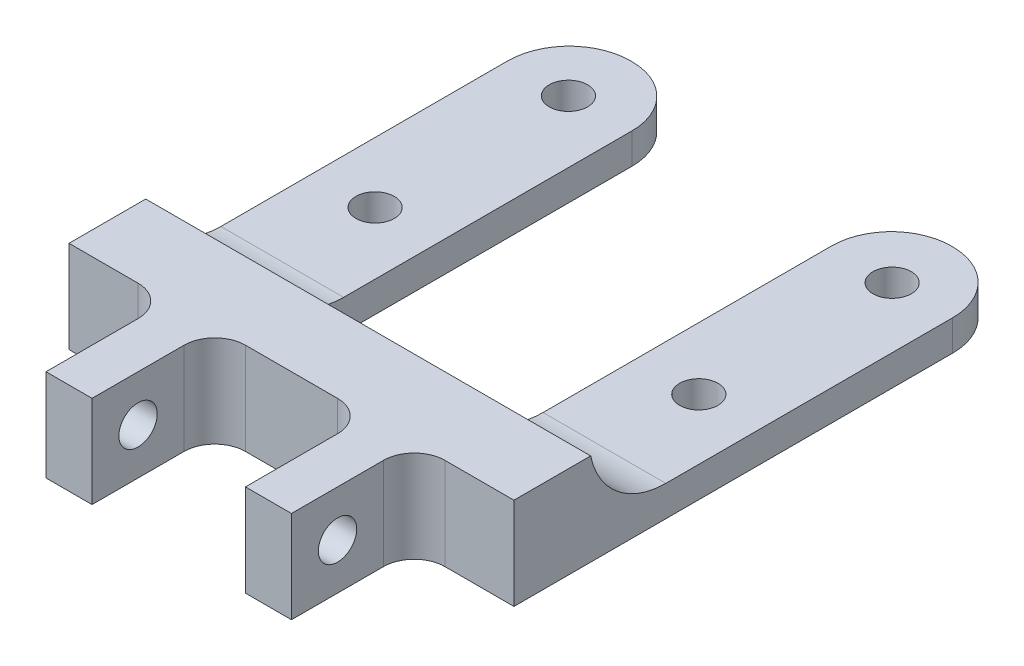
ISO-10303-21;
HEADER;
FILE_DESCRIPTION(('STEP AP214'),'2;1');
FILE_NAME('part.step','',(''),(''),'','','');
FILE_SCHEMA(('AUTOMOTIVE_DESIGN { 1 0 10303 214 1 1 1 1 }'));
ENDSEC;
DATA;
#1=APPLICATION_CONTEXT('core data for automotive mechanical design processes');
#2=APPLICATION_PROTOCOL_DEFINITION('international standard','automotive_design',2000,#1);
#3=PRODUCT_CONTEXT('',#1,'mechanical');
#4=PRODUCT('Part','Part','',(#3));
#5=PRODUCT_RELATED_PRODUCT_CATEGORY('part','',(#4));
#6=PRODUCT_DEFINITION_FORMATION('','',#4);
#7=PRODUCT_DEFINITION_CONTEXT('part definition',#1,'design');
#8=PRODUCT_DEFINITION('design','',#6,#7);
#9=PRODUCT_DEFINITION_SHAPE('','',#8);
#10=(LENGTH_UNIT() NAMED_UNIT(*) SI_UNIT(.MILLI.,.METRE.));
#11=(NAMED_UNIT(*) PLANE_ANGLE_UNIT() SI_UNIT($,.RADIAN.));
#12=(NAMED_UNIT(*) SI_UNIT($,.STERADIAN.) SOLID_ANGLE_UNIT());
#13=UNCERTAINTY_MEASURE_WITH_UNIT(LENGTH_MEASURE(1.E-05),#10,'distance_accuracy_value','');
#14=(GEOMETRIC_REPRESENTATION_CONTEXT(3) GLOBAL_UNCERTAINTY_ASSIGNED_CONTEXT((#13)) GLOBAL_UNIT_ASSIGNED_CONTEXT((#10,
#11,#12)) REPRESENTATION_CONTEXT('',''));
#15=CARTESIAN_POINT('',(0.,0.,0.));
#16=DIRECTION('',(0.,0.,1.));
#17=DIRECTION('',(1.,0.,0.));
#18=AXIS2_PLACEMENT_3D('',#15,#16,#17);
#19=CARTESIAN_POINT('',(0.,0.,5.));
#20=DIRECTION('',(0.,0.,1.));
#21=DIRECTION('',(1.,0.,0.));
#22=AXIS2_PLACEMENT_3D('',#19,#20,#21);
#23=PLANE('',#22);
#24=DIRECTION('',(1.,0.,0.));
#25=VECTOR('',#24,1.);
#26=CARTESIAN_POINT('',(0.,0.,5.));
#27=LINE('',#26,#25);
#28=CARTESIAN_POINT('',(11.5,0.,5.));
#29=VERTEX_POINT('',#28);
#30=CARTESIAN_POINT('',(17.5,0.,5.));
#31=VERTEX_POINT('',#30);
#32=EDGE_CURVE('E286',#29,#31,#27,.T.);
#33=ORIENTED_EDGE('',*,*,#32,.T.);
#34=DIRECTION('',(0.,-1.,0.));
#35=VECTOR('',#34,1.);
#36=CARTESIAN_POINT('',(17.5,0.,5.));
#37=LINE('',#36,#35);
#38=CARTESIAN_POINT('',(17.5,6.,5.));
#39=VERTEX_POINT('',#38);
#40=EDGE_CURVE('E414',#31,#39,#37,.F.);
#41=ORIENTED_EDGE('',*,*,#40,.T.);
#42=DIRECTION('',(1.,0.,0.));
#43=VECTOR('',#42,1.);
#44=CARTESIAN_POINT('',(0.,6.,5.));
#45=LINE('',#44,#43);
#46=CARTESIAN_POINT('',(11.5,6.,5.));
#47=VERTEX_POINT('',#46);
#48=EDGE_CURVE('E277',#47,#39,#45,.T.);
#49=ORIENTED_EDGE('',*,*,#48,.F.);
#50=DIRECTION('',(0.,1.,0.));
#51=VECTOR('',#50,1.);
#52=CARTESIAN_POINT('',(11.5,0.,5.));
#53=LINE('',#52,#51);
#54=EDGE_CURVE('E412',#47,#29,#53,.F.);
#55=ORIENTED_EDGE('',*,*,#54,.T.);
#56=EDGE_LOOP('',(#33,#41,#49,#55));
#57=FACE_BOUND('',#56,.T.);
#58=ADVANCED_FACE('F39',(#57),#23,.T.);
#59=CARTESIAN_POINT('',(24.5,6.,5.));
#60=VERTEX_POINT('',#59);
#61=CARTESIAN_POINT('',(29.,6.,5.));
#62=VERTEX_POINT('',#61);
#63=EDGE_CURVE('E273',#60,#62,#45,.T.);
#64=ORIENTED_EDGE('',*,*,#63,.F.);
#65=DIRECTION('',(0.,1.,0.));
#66=VECTOR('',#65,1.);
#67=CARTESIAN_POINT('',(24.5,0.,5.));
#68=LINE('',#67,#66);
#69=CARTESIAN_POINT('',(24.5,0.,5.));
#70=VERTEX_POINT('',#69);
#71=EDGE_CURVE('E419',#60,#70,#68,.F.);
#72=ORIENTED_EDGE('',*,*,#71,.T.);
#73=CARTESIAN_POINT('',(29.,0.,5.));
#74=VERTEX_POINT('',#73);
#75=EDGE_CURVE('E282',#70,#74,#27,.T.);
#76=ORIENTED_EDGE('',*,*,#75,.T.);
#77=DIRECTION('',(0.,1.,0.));
#78=VECTOR('',#77,1.);
#79=CARTESIAN_POINT('',(29.,0.,5.));
#80=LINE('',#79,#78);
#81=EDGE_CURVE('E287',#74,#62,#80,.T.);
#82=ORIENTED_EDGE('',*,*,#81,.T.);
#83=EDGE_LOOP('',(#64,#72,#76,#82));
#84=FACE_BOUND('',#83,.T.);
#85=ADVANCED_FACE('F467',(#84),#23,.T.);
#86=CARTESIAN_POINT('',(0.,2.,0.));
#87=DIRECTION('',(0.,1.,0.));
#88=DIRECTION('',(0.,0.,1.));
#89=AXIS2_PLACEMENT_3D('',#86,#87,#88);
#90=PLANE('',#89);
#91=CARTESIAN_POINT('',(3.95,2.,-23.6));
#92=DIRECTION('',(0.,1.,0.));
#93=DIRECTION('',(0.,0.,1.));
#94=AXIS2_PLACEMENT_3D('',#91,#92,#93);
#95=CIRCLE('',#94,1.25);
#96=CARTESIAN_POINT('',(3.95,2.,-22.35));
#97=VERTEX_POINT('',#96);
#98=EDGE_CURVE('E329',#97,#97,#95,.T.);
#99=ORIENTED_EDGE('',*,*,#98,.F.);
#100=EDGE_LOOP('',(#99));
#101=FACE_BOUND('',#100,.T.);
#102=CARTESIAN_POINT('',(3.95,2.,-11.));
#103=DIRECTION('',(0.,1.,0.));
#104=DIRECTION('',(0.,0.,1.));
#105=AXIS2_PLACEMENT_3D('',#102,#103,#104);
#106=CIRCLE('',#105,1.25);
#107=CARTESIAN_POINT('',(3.95,2.,-9.75));
#108=VERTEX_POINT('',#107);
#109=EDGE_CURVE('E320',#108,#108,#106,.T.);
#110=ORIENTED_EDGE('',*,*,#109,.F.);
#111=EDGE_LOOP('',(#110));
#112=FACE_BOUND('',#111,.T.);
#113=DIRECTION('',(0.,0.,-1.));
#114=VECTOR('',#113,1.);
#115=CARTESIAN_POINT('',(0.,2.,0.));
#116=LINE('',#115,#114);
#117=CARTESIAN_POINT('',(0.,2.,-4.89897948556636));
#118=VERTEX_POINT('',#117);
#119=CARTESIAN_POINT('',(0.,2.,-23.6));
#120=VERTEX_POINT('',#119);
#121=EDGE_CURVE('E302',#118,#120,#116,.T.);
#122=ORIENTED_EDGE('',*,*,#121,.F.);
#123=DIRECTION('',(-1.,0.,0.));
#124=VECTOR('',#123,1.);
#125=CARTESIAN_POINT('',(29.,2.,-4.89897948556636));
#126=LINE('',#125,#124);
#127=CARTESIAN_POINT('',(8.,2.,-4.89897948556636));
#128=VERTEX_POINT('',#127);
#129=EDGE_CURVE('E396',#118,#128,#126,.F.);
#130=ORIENTED_EDGE('',*,*,#129,.T.);
#131=DIRECTION('',(0.,0.,1.));
#132=VECTOR('',#131,1.);
#133=CARTESIAN_POINT('',(8.,2.,0.));
#134=LINE('',#133,#132);
#135=CARTESIAN_POINT('',(8.,2.,-23.7));
#136=VERTEX_POINT('',#135);
#137=EDGE_CURVE('E317',#136,#128,#134,.T.);
#138=ORIENTED_EDGE('',*,*,#137,.F.);
#139=CARTESIAN_POINT('',(4.1,2.,-23.7));
#140=DIRECTION('',(0.,1.,0.));
#141=DIRECTION('',(0.,0.,1.));
#142=AXIS2_PLACEMENT_3D('',#139,#140,#141);
#143=CIRCLE('',#142,3.9);
#144=CARTESIAN_POINT('',(4.1,2.,-27.6));
#145=VERTEX_POINT('',#144);
#146=EDGE_CURVE('E292',#145,#136,#143,.F.);
#147=ORIENTED_EDGE('',*,*,#146,.F.);
#148=DIRECTION('',(1.,0.,0.));
#149=VECTOR('',#148,1.);
#150=CARTESIAN_POINT('',(0.,2.,-27.6));
#151=LINE('',#150,#149);
#152=CARTESIAN_POINT('',(4.,2.,-27.6));
#153=VERTEX_POINT('',#152);
#154=EDGE_CURVE('E295',#153,#145,#151,.T.);
#155=ORIENTED_EDGE('',*,*,#154,.F.);
#156=CARTESIAN_POINT('',(4.,2.,-23.6));
#157=DIRECTION('',(0.,1.,0.));
#158=DIRECTION('',(0.,0.,1.));
#159=AXIS2_PLACEMENT_3D('',#156,#157,#158);
#160=CIRCLE('',#159,4.);
#161=EDGE_CURVE('E299',#120,#153,#160,.F.);
#162=ORIENTED_EDGE('',*,*,#161,.F.);
#163=EDGE_LOOP('',(#122,#130,#138,#147,#155,#162));
#164=FACE_BOUND('',#163,.T.);
#165=ADVANCED_FACE('F513',(#101,#112,#164),#90,.T.);
#166=CARTESIAN_POINT('',(4.1,2.,-23.7));
#167=DIRECTION('',(0.,-1.,0.));
#168=DIRECTION('',(0.,0.,-1.));
#169=AXIS2_PLACEMENT_3D('',#166,#167,#168);
#170=CYLINDRICAL_SURFACE('',#169,3.9);
#171=CARTESIAN_POINT('',(4.1,0.,-23.7));
#172=DIRECTION('',(0.,1.,0.));
#173=DIRECTION('',(0.,0.,1.));
#174=AXIS2_PLACEMENT_3D('',#171,#172,#173);
#175=CIRCLE('',#174,3.9);
#176=CARTESIAN_POINT('',(4.1,0.,-27.6));
#177=VERTEX_POINT('',#176);
#178=CARTESIAN_POINT('',(8.,0.,-23.7));
#179=VERTEX_POINT('',#178);
#180=EDGE_CURVE('E290',#177,#179,#175,.F.);
#181=ORIENTED_EDGE('',*,*,#180,.F.);
#182=DIRECTION('',(0.,-1.,0.));
#183=VECTOR('',#182,1.);
#184=CARTESIAN_POINT('',(4.1,2.,-27.6));
#185=LINE('',#184,#183);
#186=EDGE_CURVE('E392',#145,#177,#185,.T.);
#187=ORIENTED_EDGE('',*,*,#186,.F.);
#188=ORIENTED_EDGE('',*,*,#146,.T.);
#189=DIRECTION('',(0.,-1.,0.));
#190=VECTOR('',#189,1.);
#191=CARTESIAN_POINT('',(8.,2.,-23.7));
#192=LINE('',#191,#190);
#193=EDGE_CURVE('E332',#136,#179,#192,.T.);
#194=ORIENTED_EDGE('',*,*,#193,.T.);
#195=EDGE_LOOP('',(#181,#187,#188,#194));
#196=FACE_BOUND('',#195,.T.);
#197=ADVANCED_FACE('F579',(#196),#170,.T.);
#198=CARTESIAN_POINT('',(0.,2.,-27.6));
#199=DIRECTION('',(0.,0.,-1.));
#200=DIRECTION('',(-1.,0.,0.));
#201=AXIS2_PLACEMENT_3D('',#198,#199,#200);
#202=PLANE('',#201);
#203=DIRECTION('',(1.,0.,0.));
#204=VECTOR('',#203,1.);
#205=CARTESIAN_POINT('',(0.,0.,-27.6));
#206=LINE('',#205,#204);
#207=CARTESIAN_POINT('',(4.,0.,-27.6));
#208=VERTEX_POINT('',#207);
#209=EDGE_CURVE('E334',#208,#177,#206,.T.);
#210=ORIENTED_EDGE('',*,*,#209,.F.);
#211=DIRECTION('',(0.,-1.,0.));
#212=VECTOR('',#211,1.);
#213=CARTESIAN_POINT('',(4.,2.,-27.6));
#214=LINE('',#213,#212);
#215=EDGE_CURVE('E390',#153,#208,#214,.T.);
#216=ORIENTED_EDGE('',*,*,#215,.F.);
#217=ORIENTED_EDGE('',*,*,#154,.T.);
#218=ORIENTED_EDGE('',*,*,#186,.T.);
#219=EDGE_LOOP('',(#210,#216,#217,#218));
#220=FACE_BOUND('',#219,.T.);
#221=ADVANCED_FACE('F575',(#220),#202,.T.);
#222=CARTESIAN_POINT('',(4.,2.,-23.6));
#223=DIRECTION('',(0.,-1.,0.));
#224=DIRECTION('',(0.,0.,-1.));
#225=AXIS2_PLACEMENT_3D('',#222,#223,#224);
#226=CYLINDRICAL_SURFACE('',#225,4.);
#227=CARTESIAN_POINT('',(4.,0.,-23.6));
#228=DIRECTION('',(0.,1.,0.));
#229=DIRECTION('',(0.,0.,1.));
#230=AXIS2_PLACEMENT_3D('',#227,#228,#229);
#231=CIRCLE('',#230,4.);
#232=CARTESIAN_POINT('',(0.,0.,-23.6));
#233=VERTEX_POINT('',#232);
#234=EDGE_CURVE('E337',#233,#208,#231,.F.);
#235=ORIENTED_EDGE('',*,*,#234,.F.);
#236=DIRECTION('',(0.,-1.,0.));
#237=VECTOR('',#236,1.);
#238=CARTESIAN_POINT('',(0.,2.,-23.6));
#239=LINE('',#238,#237);
#240=EDGE_CURVE('E388',#120,#233,#239,.T.);
#241=ORIENTED_EDGE('',*,*,#240,.F.);
#242=ORIENTED_EDGE('',*,*,#161,.T.);
#243=ORIENTED_EDGE('',*,*,#215,.T.);
#244=EDGE_LOOP('',(#235,#241,#242,#243));
#245=FACE_BOUND('',#244,.T.);
#246=ADVANCED_FACE('F572',(#245),#226,.T.);
#247=CARTESIAN_POINT('',(0.,2.,0.));
#248=DIRECTION('',(-1.,0.,0.));
#249=DIRECTION('',(0.,0.,1.));
#250=AXIS2_PLACEMENT_3D('',#247,#248,#249);
#251=PLANE('',#250);
#252=DIRECTION('',(0.,0.,-1.));
#253=VECTOR('',#252,1.);
#254=CARTESIAN_POINT('',(0.,0.,0.));
#255=LINE('',#254,#253);
#256=CARTESIAN_POINT('',(0.,0.,5.));
#257=VERTEX_POINT('',#256);
#258=EDGE_CURVE('E340',#257,#233,#255,.T.);
#259=ORIENTED_EDGE('',*,*,#258,.F.);
#260=DIRECTION('',(0.,1.,0.));
#261=VECTOR('',#260,1.);
#262=CARTESIAN_POINT('',(0.,0.,5.));
#263=LINE('',#262,#261);
#264=CARTESIAN_POINT('',(0.,6.,5.));
#265=VERTEX_POINT('',#264);
#266=EDGE_CURVE('E285',#257,#265,#263,.T.);
#267=ORIENTED_EDGE('',*,*,#266,.T.);
#268=DIRECTION('',(0.,0.,1.));
#269=VECTOR('',#268,1.);
#270=CARTESIAN_POINT('',(0.,6.,0.));
#271=LINE('',#270,#269);
#272=CARTESIAN_POINT('',(0.,6.,0.));
#273=VERTEX_POINT('',#272);
#274=EDGE_CURVE('E270',#273,#265,#271,.T.);
#275=ORIENTED_EDGE('',*,*,#274,.F.);
#276=CARTESIAN_POINT('',(0.,7.,-4.89897948556636));
#277=DIRECTION('',(-1.,0.,0.));
#278=DIRECTION('',(0.,0.,1.));
#279=AXIS2_PLACEMENT_3D('',#276,#277,#278);
#280=CIRCLE('',#279,5.);
#281=EDGE_CURVE('E409',#273,#118,#280,.F.);
#282=ORIENTED_EDGE('',*,*,#281,.T.);
#283=ORIENTED_EDGE('',*,*,#121,.T.);
#284=ORIENTED_EDGE('',*,*,#240,.T.);
#285=EDGE_LOOP('',(#259,#267,#275,#282,#283,#284));
#286=FACE_BOUND('',#285,.T.);
#287=ADVANCED_FACE('F483',(#286),#251,.T.);
#288=CARTESIAN_POINT('',(29.,2.,0.));
#289=DIRECTION('',(-1.,0.,0.));
#290=DIRECTION('',(0.,0.,1.));
#291=AXIS2_PLACEMENT_3D('',#288,#289,#290);
#292=PLANE('',#291);
#293=DIRECTION('',(0.,0.,-1.));
#294=VECTOR('',#293,1.);
#295=CARTESIAN_POINT('',(29.,0.,0.));
#296=LINE('',#295,#294);
#297=CARTESIAN_POINT('',(29.,0.,-23.6));
#298=VERTEX_POINT('',#297);
#299=EDGE_CURVE('E343',#74,#298,#296,.T.);
#300=ORIENTED_EDGE('',*,*,#299,.T.);
#301=DIRECTION('',(0.,-1.,0.));
#302=VECTOR('',#301,1.);
#303=CARTESIAN_POINT('',(29.,2.,-23.6));
#304=LINE('',#303,#302);
#305=CARTESIAN_POINT('',(29.,2.,-23.6));
#306=VERTEX_POINT('',#305);
#307=EDGE_CURVE('E386',#306,#298,#304,.T.);
#308=ORIENTED_EDGE('',*,*,#307,.F.);
#309=DIRECTION('',(0.,0.,-1.));
#310=VECTOR('',#309,1.);
#311=CARTESIAN_POINT('',(29.,2.,0.));
#312=LINE('',#311,#310);
#313=CARTESIAN_POINT('',(29.,2.,-4.89897948556636));
#314=VERTEX_POINT('',#313);
#315=EDGE_CURVE('E304',#314,#306,#312,.T.);
#316=ORIENTED_EDGE('',*,*,#315,.F.);
#317=CARTESIAN_POINT('',(29.,7.,-4.89897948556636));
#318=DIRECTION('',(-1.,0.,0.));
#319=DIRECTION('',(0.,0.,1.));
#320=AXIS2_PLACEMENT_3D('',#317,#318,#319);
#321=CIRCLE('',#320,5.);
#322=CARTESIAN_POINT('',(29.,6.,0.));
#323=VERTEX_POINT('',#322);
#324=EDGE_CURVE('E407',#314,#323,#321,.T.);
#325=ORIENTED_EDGE('',*,*,#324,.T.);
#326=DIRECTION('',(0.,0.,-1.));
#327=VECTOR('',#326,1.);
#328=CARTESIAN_POINT('',(29.,6.,0.));
#329=LINE('',#328,#327);
#330=EDGE_CURVE('E276',#62,#323,#329,.T.);
#331=ORIENTED_EDGE('',*,*,#330,.F.);
#332=ORIENTED_EDGE('',*,*,#81,.F.);
#333=EDGE_LOOP('',(#300,#308,#316,#325,#331,#332));
#334=FACE_BOUND('',#333,.T.);
#335=ADVANCED_FACE('F471',(#334),#292,.F.);
#336=CARTESIAN_POINT('',(25.,2.,-23.6));
#337=DIRECTION('',(0.,-1.,0.));
#338=DIRECTION('',(0.,0.,-1.));
#339=AXIS2_PLACEMENT_3D('',#336,#337,#338);
#340=CYLINDRICAL_SURFACE('',#339,4.);
#341=CARTESIAN_POINT('',(25.,0.,-23.6));
#342=DIRECTION('',(0.,1.,0.));
#343=DIRECTION('',(0.,0.,1.));
#344=AXIS2_PLACEMENT_3D('',#341,#342,#343);
#345=CIRCLE('',#344,4.);
#346=CARTESIAN_POINT('',(25.,0.,-27.6));
#347=VERTEX_POINT('',#346);
#348=EDGE_CURVE('E346',#347,#298,#345,.F.);
#349=ORIENTED_EDGE('',*,*,#348,.F.);
#350=DIRECTION('',(0.,-1.,0.));
#351=VECTOR('',#350,1.);
#352=CARTESIAN_POINT('',(25.,2.,-27.6));
#353=LINE('',#352,#351);
#354=CARTESIAN_POINT('',(25.,2.,-27.6));
#355=VERTEX_POINT('',#354);
#356=EDGE_CURVE('E384',#355,#347,#353,.T.);
#357=ORIENTED_EDGE('',*,*,#356,.F.);
#358=CARTESIAN_POINT('',(25.,2.,-23.6));
#359=DIRECTION('',(0.,1.,0.));
#360=DIRECTION('',(0.,0.,1.));
#361=AXIS2_PLACEMENT_3D('',#358,#359,#360);
#362=CIRCLE('',#361,4.);
#363=EDGE_CURVE('E306',#355,#306,#362,.F.);
#364=ORIENTED_EDGE('',*,*,#363,.T.);
#365=ORIENTED_EDGE('',*,*,#307,.T.);
#366=EDGE_LOOP('',(#349,#357,#364,#365));
#367=FACE_BOUND('',#366,.T.);
#368=ADVANCED_FACE('F563',(#367),#340,.T.);
#369=CARTESIAN_POINT('',(0.,2.,-27.6));
#370=DIRECTION('',(0.,0.,-1.));
#371=DIRECTION('',(-1.,0.,0.));
#372=AXIS2_PLACEMENT_3D('',#369,#370,#371);
#373=PLANE('',#372);
#374=DIRECTION('',(1.,0.,0.));
#375=VECTOR('',#374,1.);
#376=CARTESIAN_POINT('',(0.,0.,-27.6));
#377=LINE('',#376,#375);
#378=CARTESIAN_POINT('',(24.9,0.,-27.6));
#379=VERTEX_POINT('',#378);
#380=EDGE_CURVE('E349',#379,#347,#377,.T.);
#381=ORIENTED_EDGE('',*,*,#380,.F.);
#382=DIRECTION('',(0.,-1.,0.));
#383=VECTOR('',#382,1.);
#384=CARTESIAN_POINT('',(24.9,2.,-27.6));
#385=LINE('',#384,#383);
#386=CARTESIAN_POINT('',(24.9,2.,-27.6));
#387=VERTEX_POINT('',#386);
#388=EDGE_CURVE('E382',#387,#379,#385,.T.);
#389=ORIENTED_EDGE('',*,*,#388,.F.);
#390=DIRECTION('',(1.,0.,0.));
#391=VECTOR('',#390,1.);
#392=CARTESIAN_POINT('',(0.,2.,-27.6));
#393=LINE('',#392,#391);
#394=EDGE_CURVE('E309',#387,#355,#393,.T.);
#395=ORIENTED_EDGE('',*,*,#394,.T.);
#396=ORIENTED_EDGE('',*,*,#356,.T.);
#397=EDGE_LOOP('',(#381,#389,#395,#396));
#398=FACE_BOUND('',#397,.T.);
#399=ADVANCED_FACE('F559',(#398),#373,.T.);
#400=CARTESIAN_POINT('',(24.9,2.,-23.7));
#401=DIRECTION('',(0.,-1.,0.));
#402=DIRECTION('',(0.,0.,-1.));
#403=AXIS2_PLACEMENT_3D('',#400,#401,#402);
#404=CYLINDRICAL_SURFACE('',#403,3.9);
#405=CARTESIAN_POINT('',(24.9,0.,-23.7));
#406=DIRECTION('',(0.,1.,0.));
#407=DIRECTION('',(0.,0.,1.));
#408=AXIS2_PLACEMENT_3D('',#405,#406,#407);
#409=CIRCLE('',#408,3.9);
#410=CARTESIAN_POINT('',(21.,0.,-23.7));
#411=VERTEX_POINT('',#410);
#412=EDGE_CURVE('E352',#379,#411,#409,.T.);
#413=ORIENTED_EDGE('',*,*,#412,.T.);
#414=DIRECTION('',(0.,-1.,0.));
#415=VECTOR('',#414,1.);
#416=CARTESIAN_POINT('',(21.,2.,-23.7));
#417=LINE('',#416,#415);
#418=CARTESIAN_POINT('',(21.,2.,-23.7));
#419=VERTEX_POINT('',#418);
#420=EDGE_CURVE('E379',#419,#411,#417,.T.);
#421=ORIENTED_EDGE('',*,*,#420,.F.);
#422=CARTESIAN_POINT('',(24.9,2.,-23.7));
#423=DIRECTION('',(0.,1.,0.));
#424=DIRECTION('',(0.,0.,1.));
#425=AXIS2_PLACEMENT_3D('',#422,#423,#424);
#426=CIRCLE('',#425,3.9);
#427=EDGE_CURVE('E312',#387,#419,#426,.T.);
#428=ORIENTED_EDGE('',*,*,#427,.F.);
#429=ORIENTED_EDGE('',*,*,#388,.T.);
#430=EDGE_LOOP('',(#413,#421,#428,#429));
#431=FACE_BOUND('',#430,.T.);
#432=ADVANCED_FACE('F555',(#431),#404,.T.);
#433=CARTESIAN_POINT('',(21.,2.,0.));
#434=DIRECTION('',(1.,0.,0.));
#435=DIRECTION('',(0.,0.,-1.));
#436=AXIS2_PLACEMENT_3D('',#433,#434,#435);
#437=PLANE('',#436);
#438=DIRECTION('',(0.,0.,1.));
#439=VECTOR('',#438,1.);
#440=CARTESIAN_POINT('',(21.,0.,0.));
#441=LINE('',#440,#439);
#442=CARTESIAN_POINT('',(21.,0.,-3.5));
#443=VERTEX_POINT('',#442);
#444=EDGE_CURVE('E354',#411,#443,#441,.T.);
#445=ORIENTED_EDGE('',*,*,#444,.T.);
#446=DIRECTION('',(0.,-1.,0.));
#447=VECTOR('',#446,1.);
#448=CARTESIAN_POINT('',(21.,2.,-3.5));
#449=LINE('',#448,#447);
#450=CARTESIAN_POINT('',(21.,2.1997024676626,-3.5));
#451=VERTEX_POINT('',#450);
#452=EDGE_CURVE('E377',#451,#443,#449,.T.);
#453=ORIENTED_EDGE('',*,*,#452,.F.);
#454=CARTESIAN_POINT('',(21.,7.,-4.89897948556636));
#455=DIRECTION('',(1.,0.,0.));
#456=DIRECTION('',(0.,0.,-1.));
#457=AXIS2_PLACEMENT_3D('',#454,#455,#456);
#458=CIRCLE('',#457,5.);
#459=CARTESIAN_POINT('',(21.,2.,-4.89897948556636));
#460=VERTEX_POINT('',#459);
#461=EDGE_CURVE('E405',#451,#460,#458,.T.);
#462=ORIENTED_EDGE('',*,*,#461,.T.);
#463=DIRECTION('',(0.,0.,1.));
#464=VECTOR('',#463,1.);
#465=CARTESIAN_POINT('',(21.,2.,0.));
#466=LINE('',#465,#464);
#467=EDGE_CURVE('E314',#419,#460,#466,.T.);
#468=ORIENTED_EDGE('',*,*,#467,.F.);
#469=ORIENTED_EDGE('',*,*,#420,.T.);
#470=EDGE_LOOP('',(#445,#453,#462,#468,#469));
#471=FACE_BOUND('',#470,.T.);
#472=ADVANCED_FACE('F551',(#471),#437,.F.);
#473=CARTESIAN_POINT('',(0.,2.,-3.5));
#474=DIRECTION('',(0.,0.,-1.));
#475=DIRECTION('',(-1.,0.,0.));
#476=AXIS2_PLACEMENT_3D('',#473,#474,#475);
#477=PLANE('',#476);
#478=DIRECTION('',(1.,0.,0.));
#479=VECTOR('',#478,1.);
#480=CARTESIAN_POINT('',(0.,0.,-3.5));
#481=LINE('',#480,#479);
#482=CARTESIAN_POINT('',(8.,0.,-3.5));
#483=VERTEX_POINT('',#482);
#484=EDGE_CURVE('E357',#483,#443,#481,.T.);
#485=ORIENTED_EDGE('',*,*,#484,.F.);
#486=DIRECTION('',(0.,-1.,0.));
#487=VECTOR('',#486,1.);
#488=CARTESIAN_POINT('',(8.,2.,-3.5));
#489=LINE('',#488,#487);
#490=CARTESIAN_POINT('',(8.,2.1997024676626,-3.5));
#491=VERTEX_POINT('',#490);
#492=EDGE_CURVE('E375',#491,#483,#489,.T.);
#493=ORIENTED_EDGE('',*,*,#492,.F.);
#494=DIRECTION('',(1.,0.,0.));
#495=VECTOR('',#494,1.);
#496=CARTESIAN_POINT('',(8.,2.1997024676626,-3.5));
#497=LINE('',#496,#495);
#498=EDGE_CURVE('E402',#491,#451,#497,.T.);
#499=ORIENTED_EDGE('',*,*,#498,.T.);
#500=ORIENTED_EDGE('',*,*,#452,.T.);
#501=EDGE_LOOP('',(#485,#493,#499,#500));
#502=FACE_BOUND('',#501,.T.);
#503=ADVANCED_FACE('F537',(#502),#477,.T.);
#504=CARTESIAN_POINT('',(25.05,2.,-23.6));
#505=DIRECTION('',(0.,-1.,0.));
#506=DIRECTION('',(0.,0.,-1.));
#507=AXIS2_PLACEMENT_3D('',#504,#505,#506);
#508=CYLINDRICAL_SURFACE('',#507,1.25);
#509=CARTESIAN_POINT('',(25.05,2.,-23.6));
#510=DIRECTION('',(0.,1.,0.));
#511=DIRECTION('',(0.,0.,1.));
#512=AXIS2_PLACEMENT_3D('',#509,#510,#511);
#513=CIRCLE('',#512,1.25);
#514=CARTESIAN_POINT('',(25.05,2.,-22.35));
#515=VERTEX_POINT('',#514);
#516=EDGE_CURVE('E326',#515,#515,#513,.T.);
#517=ORIENTED_EDGE('',*,*,#516,.T.);
#518=EDGE_LOOP('',(#517));
#519=FACE_BOUND('',#518,.T.);
#520=CARTESIAN_POINT('',(25.05,0.,-23.6));
#521=DIRECTION('',(0.,1.,0.));
#522=DIRECTION('',(0.,0.,1.));
#523=AXIS2_PLACEMENT_3D('',#520,#521,#522);
#524=CIRCLE('',#523,1.25);
#525=CARTESIAN_POINT('',(25.05,0.,-22.35));
#526=VERTEX_POINT('',#525);
#527=EDGE_CURVE('E369',#526,#526,#524,.T.);
#528=ORIENTED_EDGE('',*,*,#527,.F.);
#529=EDGE_LOOP('',(#528));
#530=FACE_BOUND('',#529,.T.);
#531=ADVANCED_FACE('F533',(#519,#530),#508,.F.);
#532=CARTESIAN_POINT('',(25.05,2.,-11.));
#533=DIRECTION('',(0.,-1.,0.));
#534=DIRECTION('',(0.,0.,-1.));
#535=AXIS2_PLACEMENT_3D('',#532,#533,#534);
#536=CYLINDRICAL_SURFACE('',#535,1.25);
#537=CARTESIAN_POINT('',(25.05,2.,-11.));
#538=DIRECTION('',(0.,1.,0.));
#539=DIRECTION('',(0.,0.,1.));
#540=AXIS2_PLACEMENT_3D('',#537,#538,#539);
#541=CIRCLE('',#540,1.25);
#542=CARTESIAN_POINT('',(25.05,2.,-9.75));
#543=VERTEX_POINT('',#542);
#544=EDGE_CURVE('E323',#543,#543,#541,.T.);
#545=ORIENTED_EDGE('',*,*,#544,.T.);
#546=EDGE_LOOP('',(#545));
#547=FACE_BOUND('',#546,.T.);
#548=CARTESIAN_POINT('',(25.05,0.,-11.));
#549=DIRECTION('',(0.,1.,0.));
#550=DIRECTION('',(0.,0.,1.));
#551=AXIS2_PLACEMENT_3D('',#548,#549,#550);
#552=CIRCLE('',#551,1.25);
#553=CARTESIAN_POINT('',(25.05,0.,-9.75));
#554=VERTEX_POINT('',#553);
#555=EDGE_CURVE('E366',#554,#554,#552,.T.);
#556=ORIENTED_EDGE('',*,*,#555,.F.);
#557=EDGE_LOOP('',(#556));
#558=FACE_BOUND('',#557,.T.);
#559=ADVANCED_FACE('F536',(#547,#558),#536,.F.);
#560=CARTESIAN_POINT('',(3.95,2.,-11.));
#561=DIRECTION('',(0.,-1.,0.));
#562=DIRECTION('',(0.,0.,-1.));
#563=AXIS2_PLACEMENT_3D('',#560,#561,#562);
#564=CYLINDRICAL_SURFACE('',#563,1.25);
#565=ORIENTED_EDGE('',*,*,#109,.T.);
#566=EDGE_LOOP('',(#565));
#567=FACE_BOUND('',#566,.T.);
#568=CARTESIAN_POINT('',(3.95,0.,-11.));
#569=DIRECTION('',(0.,1.,0.));
#570=DIRECTION('',(0.,0.,1.));
#571=AXIS2_PLACEMENT_3D('',#568,#569,#570);
#572=CIRCLE('',#571,1.25);
#573=CARTESIAN_POINT('',(3.95,0.,-9.75));
#574=VERTEX_POINT('',#573);
#575=EDGE_CURVE('E363',#574,#574,#572,.T.);
#576=ORIENTED_EDGE('',*,*,#575,.F.);
#577=EDGE_LOOP('',(#576));
#578=FACE_BOUND('',#577,.T.);
#579=ADVANCED_FACE('F541',(#567,#578),#564,.F.);
#580=CARTESIAN_POINT('',(8.,2.,0.));
#581=DIRECTION('',(1.,0.,0.));
#582=DIRECTION('',(0.,0.,-1.));
#583=AXIS2_PLACEMENT_3D('',#580,#581,#582);
#584=PLANE('',#583);
#585=DIRECTION('',(0.,0.,1.));
#586=VECTOR('',#585,1.);
#587=CARTESIAN_POINT('',(8.,0.,0.));
#588=LINE('',#587,#586);
#589=EDGE_CURVE('E360',#179,#483,#588,.T.);
#590=ORIENTED_EDGE('',*,*,#589,.F.);
#591=ORIENTED_EDGE('',*,*,#193,.F.);
#592=ORIENTED_EDGE('',*,*,#137,.T.);
#593=CARTESIAN_POINT('',(8.,7.,-4.89897948556636));
#594=DIRECTION('',(1.,0.,0.));
#595=DIRECTION('',(0.,0.,-1.));
#596=AXIS2_PLACEMENT_3D('',#593,#594,#595);
#597=CIRCLE('',#596,5.);
#598=EDGE_CURVE('E399',#128,#491,#597,.F.);
#599=ORIENTED_EDGE('',*,*,#598,.T.);
#600=ORIENTED_EDGE('',*,*,#492,.T.);
#601=EDGE_LOOP('',(#590,#591,#592,#599,#600));
#602=FACE_BOUND('',#601,.T.);
#603=ADVANCED_FACE('F531',(#602),#584,.T.);
#604=CARTESIAN_POINT('',(3.95,2.,-23.6));
#605=DIRECTION('',(0.,-1.,0.));
#606=DIRECTION('',(0.,0.,-1.));
#607=AXIS2_PLACEMENT_3D('',#604,#605,#606);
#608=CYLINDRICAL_SURFACE('',#607,1.25);
#609=ORIENTED_EDGE('',*,*,#98,.T.);
#610=EDGE_LOOP('',(#609));
#611=FACE_BOUND('',#610,.T.);
#612=CARTESIAN_POINT('',(3.95,0.,-23.6));
#613=DIRECTION('',(0.,1.,0.));
#614=DIRECTION('',(0.,0.,1.));
#615=AXIS2_PLACEMENT_3D('',#612,#613,#614);
#616=CIRCLE('',#615,1.25);
#617=CARTESIAN_POINT('',(3.95,0.,-22.35));
#618=VERTEX_POINT('',#617);
#619=EDGE_CURVE('E296',#618,#618,#616,.T.);
#620=ORIENTED_EDGE('',*,*,#619,.F.);
#621=EDGE_LOOP('',(#620));
#622=FACE_BOUND('',#621,.T.);
#623=ADVANCED_FACE('F526',(#611,#622),#608,.F.);
#624=ORIENTED_EDGE('',*,*,#467,.T.);
#625=DIRECTION('',(-1.,0.,0.));
#626=VECTOR('',#625,1.);
#627=CARTESIAN_POINT('',(29.,2.,-4.89897948556636));
#628=LINE('',#627,#626);
#629=EDGE_CURVE('E394',#460,#314,#628,.F.);
#630=ORIENTED_EDGE('',*,*,#629,.T.);
#631=ORIENTED_EDGE('',*,*,#315,.T.);
#632=ORIENTED_EDGE('',*,*,#363,.F.);
#633=ORIENTED_EDGE('',*,*,#394,.F.);
#634=ORIENTED_EDGE('',*,*,#427,.T.);
#635=EDGE_LOOP('',(#624,#630,#631,#632,#633,#634));
#636=FACE_BOUND('',#635,.T.);
#637=ORIENTED_EDGE('',*,*,#544,.F.);
#638=EDGE_LOOP('',(#637));
#639=FACE_BOUND('',#638,.T.);
#640=ORIENTED_EDGE('',*,*,#516,.F.);
#641=EDGE_LOOP('',(#640));
#642=FACE_BOUND('',#641,.T.);
#643=ADVANCED_FACE('F521',(#636,#639,#642),#90,.T.);
#644=CARTESIAN_POINT('',(0.,0.,0.));
#645=DIRECTION('',(0.,1.,0.));
#646=DIRECTION('',(0.,0.,1.));
#647=AXIS2_PLACEMENT_3D('',#644,#645,#646);
#648=PLANE('',#647);
#649=ORIENTED_EDGE('',*,*,#180,.T.);
#650=ORIENTED_EDGE('',*,*,#589,.T.);
#651=ORIENTED_EDGE('',*,*,#484,.T.);
#652=ORIENTED_EDGE('',*,*,#444,.F.);
#653=ORIENTED_EDGE('',*,*,#412,.F.);
#654=ORIENTED_EDGE('',*,*,#380,.T.);
#655=ORIENTED_EDGE('',*,*,#348,.T.);
#656=ORIENTED_EDGE('',*,*,#299,.F.);
#657=ORIENTED_EDGE('',*,*,#75,.F.);
#658=CARTESIAN_POINT('',(24.5,0.,7.));
#659=DIRECTION('',(0.,1.,0.));
#660=DIRECTION('',(0.,0.,1.));
#661=AXIS2_PLACEMENT_3D('',#658,#659,#660);
#662=CIRCLE('',#661,2.);
#663=CARTESIAN_POINT('',(22.5,0.,7.));
#664=VERTEX_POINT('',#663);
#665=EDGE_CURVE('E434',#70,#664,#662,.T.);
#666=ORIENTED_EDGE('',*,*,#665,.T.);
#667=DIRECTION('',(0.,0.,-1.));
#668=VECTOR('',#667,1.);
#669=CARTESIAN_POINT('',(22.5,0.,13.));
#670=LINE('',#669,#668);
#671=CARTESIAN_POINT('',(22.5,0.,13.));
#672=VERTEX_POINT('',#671);
#673=EDGE_CURVE('E226',#672,#664,#670,.T.);
#674=ORIENTED_EDGE('',*,*,#673,.F.);
#675=DIRECTION('',(1.,0.,0.));
#676=VECTOR('',#675,1.);
#677=CARTESIAN_POINT('',(19.5,0.,13.));
#678=LINE('',#677,#676);
#679=CARTESIAN_POINT('',(19.5,0.,13.));
#680=VERTEX_POINT('',#679);
#681=EDGE_CURVE('E218',#680,#672,#678,.T.);
#682=ORIENTED_EDGE('',*,*,#681,.F.);
#683=DIRECTION('',(0.,0.,-1.));
#684=VECTOR('',#683,1.);
#685=CARTESIAN_POINT('',(19.5,0.,13.));
#686=LINE('',#685,#684);
#687=CARTESIAN_POINT('',(19.5,0.,7.));
#688=VERTEX_POINT('',#687);
#689=EDGE_CURVE('E224',#680,#688,#686,.T.);
#690=ORIENTED_EDGE('',*,*,#689,.T.);
#691=CARTESIAN_POINT('',(17.5,0.,7.));
#692=DIRECTION('',(0.,1.,0.));
#693=DIRECTION('',(0.,0.,1.));
#694=AXIS2_PLACEMENT_3D('',#691,#692,#693);
#695=CIRCLE('',#694,2.);
#696=EDGE_CURVE('E428',#688,#31,#695,.T.);
#697=ORIENTED_EDGE('',*,*,#696,.T.);
#698=ORIENTED_EDGE('',*,*,#32,.F.);
#699=CARTESIAN_POINT('',(11.5,0.,7.));
#700=DIRECTION('',(0.,1.,0.));
#701=DIRECTION('',(0.,0.,1.));
#702=AXIS2_PLACEMENT_3D('',#699,#700,#701);
#703=CIRCLE('',#702,2.);
#704=CARTESIAN_POINT('',(9.5,0.,7.));
#705=VERTEX_POINT('',#704);
#706=EDGE_CURVE('E438',#29,#705,#703,.T.);
#707=ORIENTED_EDGE('',*,*,#706,.T.);
#708=DIRECTION('',(0.,0.,-1.));
#709=VECTOR('',#708,1.);
#710=CARTESIAN_POINT('',(9.5,0.,13.));
#711=LINE('',#710,#709);
#712=CARTESIAN_POINT('',(9.5,0.,13.));
#713=VERTEX_POINT('',#712);
#714=EDGE_CURVE('E259',#713,#705,#711,.T.);
#715=ORIENTED_EDGE('',*,*,#714,.F.);
#716=DIRECTION('',(1.,0.,0.));
#717=VECTOR('',#716,1.);
#718=CARTESIAN_POINT('',(9.5,0.,13.));
#719=LINE('',#718,#717);
#720=CARTESIAN_POINT('',(6.5,0.,13.));
#721=VERTEX_POINT('',#720);
#722=EDGE_CURVE('E257',#721,#713,#719,.T.);
#723=ORIENTED_EDGE('',*,*,#722,.F.);
#724=DIRECTION('',(0.,0.,-1.));
#725=VECTOR('',#724,1.);
#726=CARTESIAN_POINT('',(6.5,0.,13.));
#727=LINE('',#726,#725);
#728=CARTESIAN_POINT('',(6.5,0.,7.));
#729=VERTEX_POINT('',#728);
#730=EDGE_CURVE('E262',#721,#729,#727,.T.);
#731=ORIENTED_EDGE('',*,*,#730,.T.);
#732=CARTESIAN_POINT('',(4.5,0.,7.));
#733=DIRECTION('',(0.,1.,0.));
#734=DIRECTION('',(0.,0.,1.));
#735=AXIS2_PLACEMENT_3D('',#732,#733,#734);
#736=CIRCLE('',#735,2.);
#737=CARTESIAN_POINT('',(4.5,0.,5.));
#738=VERTEX_POINT('',#737);
#739=EDGE_CURVE('E48',#729,#738,#736,.T.);
#740=ORIENTED_EDGE('',*,*,#739,.T.);
#741=EDGE_CURVE('E283',#257,#738,#27,.T.);
#742=ORIENTED_EDGE('',*,*,#741,.F.);
#743=ORIENTED_EDGE('',*,*,#258,.T.);
#744=ORIENTED_EDGE('',*,*,#234,.T.);
#745=ORIENTED_EDGE('',*,*,#209,.T.);
#746=EDGE_LOOP('',(#649,#650,#651,#652,#653,#654,#655,#656,#657,#666,#674,#682,#690,#697,#698,
#707,#715,#723,#731,#740,#742,#743,#744,#745));
#747=FACE_BOUND('',#746,.T.);
#748=ORIENTED_EDGE('',*,*,#575,.T.);
#749=EDGE_LOOP('',(#748));
#750=FACE_BOUND('',#749,.T.);
#751=ORIENTED_EDGE('',*,*,#555,.T.);
#752=EDGE_LOOP('',(#751));
#753=FACE_BOUND('',#752,.T.);
#754=ORIENTED_EDGE('',*,*,#527,.T.);
#755=EDGE_LOOP('',(#754));
#756=FACE_BOUND('',#755,.T.);
#757=ORIENTED_EDGE('',*,*,#619,.T.);
#758=EDGE_LOOP('',(#757));
#759=FACE_BOUND('',#758,.T.);
#760=ADVANCED_FACE('F221',(#747,#750,#753,#756,#759),#648,.F.);
#761=ORIENTED_EDGE('',*,*,#741,.T.);
#762=DIRECTION('',(0.,-1.,0.));
#763=VECTOR('',#762,1.);
#764=CARTESIAN_POINT('',(4.5,0.,5.));
#765=LINE('',#764,#763);
#766=CARTESIAN_POINT('',(4.5,6.,5.));
#767=VERTEX_POINT('',#766);
#768=EDGE_CURVE('E61',#738,#767,#765,.F.);
#769=ORIENTED_EDGE('',*,*,#768,.T.);
#770=EDGE_CURVE('E274',#265,#767,#45,.T.);
#771=ORIENTED_EDGE('',*,*,#770,.F.);
#772=ORIENTED_EDGE('',*,*,#266,.F.);
#773=EDGE_LOOP('',(#761,#769,#771,#772));
#774=FACE_BOUND('',#773,.T.);
#775=ADVANCED_FACE('F486',(#774),#23,.T.);
#776=CARTESIAN_POINT('',(0.,6.,0.));
#777=DIRECTION('',(0.,1.,0.));
#778=DIRECTION('',(0.,0.,1.));
#779=AXIS2_PLACEMENT_3D('',#776,#777,#778);
#780=PLANE('',#779);
#781=ORIENTED_EDGE('',*,*,#274,.T.);
#782=ORIENTED_EDGE('',*,*,#770,.T.);
#783=CARTESIAN_POINT('',(4.5,6.,7.));
#784=DIRECTION('',(0.,1.,0.));
#785=DIRECTION('',(0.,0.,1.));
#786=AXIS2_PLACEMENT_3D('',#783,#784,#785);
#787=CIRCLE('',#786,2.);
#788=CARTESIAN_POINT('',(6.5,6.,7.));
#789=VERTEX_POINT('',#788);
#790=EDGE_CURVE('E11',#767,#789,#787,.F.);
#791=ORIENTED_EDGE('',*,*,#790,.T.);
#792=DIRECTION('',(0.,0.,-1.));
#793=VECTOR('',#792,1.);
#794=CARTESIAN_POINT('',(6.5,6.,13.));
#795=LINE('',#794,#793);
#796=CARTESIAN_POINT('',(6.5,6.,13.));
#797=VERTEX_POINT('',#796);
#798=EDGE_CURVE('E264',#797,#789,#795,.T.);
#799=ORIENTED_EDGE('',*,*,#798,.F.);
#800=DIRECTION('',(-1.,0.,0.));
#801=VECTOR('',#800,1.);
#802=CARTESIAN_POINT('',(9.5,6.,13.));
#803=LINE('',#802,#801);
#804=CARTESIAN_POINT('',(9.5,6.,13.));
#805=VERTEX_POINT('',#804);
#806=EDGE_CURVE('E248',#805,#797,#803,.T.);
#807=ORIENTED_EDGE('',*,*,#806,.F.);
#808=DIRECTION('',(0.,0.,-1.));
#809=VECTOR('',#808,1.);
#810=CARTESIAN_POINT('',(9.5,6.,13.));
#811=LINE('',#810,#809);
#812=CARTESIAN_POINT('',(9.5,6.,7.));
#813=VERTEX_POINT('',#812);
#814=EDGE_CURVE('E267',#805,#813,#811,.T.);
#815=ORIENTED_EDGE('',*,*,#814,.T.);
#816=CARTESIAN_POINT('',(11.5,6.,7.));
#817=DIRECTION('',(0.,1.,0.));
#818=DIRECTION('',(0.,0.,1.));
#819=AXIS2_PLACEMENT_3D('',#816,#817,#818);
#820=CIRCLE('',#819,2.);
#821=EDGE_CURVE('E436',#813,#47,#820,.F.);
#822=ORIENTED_EDGE('',*,*,#821,.T.);
#823=ORIENTED_EDGE('',*,*,#48,.T.);
#824=CARTESIAN_POINT('',(17.5,6.,7.));
#825=DIRECTION('',(0.,1.,0.));
#826=DIRECTION('',(0.,0.,1.));
#827=AXIS2_PLACEMENT_3D('',#824,#825,#826);
#828=CIRCLE('',#827,2.);
#829=CARTESIAN_POINT('',(19.5,6.,7.));
#830=VERTEX_POINT('',#829);
#831=EDGE_CURVE('E430',#39,#830,#828,.F.);
#832=ORIENTED_EDGE('',*,*,#831,.T.);
#833=DIRECTION('',(0.,0.,-1.));
#834=VECTOR('',#833,1.);
#835=CARTESIAN_POINT('',(19.5,6.,13.));
#836=LINE('',#835,#834);
#837=CARTESIAN_POINT('',(19.5,6.,13.));
#838=VERTEX_POINT('',#837);
#839=EDGE_CURVE('E622',#838,#830,#836,.T.);
#840=ORIENTED_EDGE('',*,*,#839,.F.);
#841=DIRECTION('',(-1.,0.,0.));
#842=VECTOR('',#841,1.);
#843=CARTESIAN_POINT('',(19.5,6.,13.));
#844=LINE('',#843,#842);
#845=CARTESIAN_POINT('',(22.5,6.,13.));
#846=VERTEX_POINT('',#845);
#847=EDGE_CURVE('E235',#846,#838,#844,.T.);
#848=ORIENTED_EDGE('',*,*,#847,.F.);
#849=DIRECTION('',(0.,0.,-1.));
#850=VECTOR('',#849,1.);
#851=CARTESIAN_POINT('',(22.5,6.,13.));
#852=LINE('',#851,#850);
#853=CARTESIAN_POINT('',(22.5,6.,7.));
#854=VERTEX_POINT('',#853);
#855=EDGE_CURVE('E250',#846,#854,#852,.T.);
#856=ORIENTED_EDGE('',*,*,#855,.T.);
#857=CARTESIAN_POINT('',(24.5,6.,7.));
#858=DIRECTION('',(0.,1.,0.));
#859=DIRECTION('',(0.,0.,1.));
#860=AXIS2_PLACEMENT_3D('',#857,#858,#859);
#861=CIRCLE('',#860,2.);
#862=EDGE_CURVE('E432',#854,#60,#861,.F.);
#863=ORIENTED_EDGE('',*,*,#862,.T.);
#864=ORIENTED_EDGE('',*,*,#63,.T.);
#865=ORIENTED_EDGE('',*,*,#330,.T.);
#866=DIRECTION('',(-1.,0.,0.));
#867=VECTOR('',#866,1.);
#868=CARTESIAN_POINT('',(0.,6.,0.));
#869=LINE('',#868,#867);
#870=EDGE_CURVE('E280',#323,#273,#869,.T.);
#871=ORIENTED_EDGE('',*,*,#870,.T.);
#872=EDGE_LOOP('',(#781,#782,#791,#799,#807,#815,#822,#823,#832,#840,#848,#856,#863,#864,#865,#871));
#873=FACE_BOUND('',#872,.T.);
#874=ADVANCED_FACE('F456',(#873),#780,.T.);
#875=CARTESIAN_POINT('',(0.,7.,-4.89897948556636));
#876=DIRECTION('',(1.,0.,0.));
#877=DIRECTION('',(0.,0.,-1.));
#878=AXIS2_PLACEMENT_3D('',#875,#876,#877);
#879=CYLINDRICAL_SURFACE('',#878,5.);
#880=ORIENTED_EDGE('',*,*,#281,.F.);
#881=ORIENTED_EDGE('',*,*,#870,.F.);
#882=ORIENTED_EDGE('',*,*,#324,.F.);
#883=ORIENTED_EDGE('',*,*,#629,.F.);
#884=ORIENTED_EDGE('',*,*,#461,.F.);
#885=ORIENTED_EDGE('',*,*,#498,.F.);
#886=ORIENTED_EDGE('',*,*,#598,.F.);
#887=ORIENTED_EDGE('',*,*,#129,.F.);
#888=EDGE_LOOP('',(#880,#881,#882,#883,#884,#885,#886,#887));
#889=FACE_BOUND('',#888,.T.);
#890=ADVANCED_FACE('F478',(#889),#879,.F.);
#891=CARTESIAN_POINT('',(9.5,6.,13.));
#892=DIRECTION('',(-1.,0.,0.));
#893=DIRECTION('',(0.,0.,1.));
#894=AXIS2_PLACEMENT_3D('',#891,#892,#893);
#895=PLANE('',#894);
#896=CARTESIAN_POINT('',(9.5,3.,10.));
#897=DIRECTION('',(-1.,0.,0.));
#898=DIRECTION('',(0.,0.,1.));
#899=AXIS2_PLACEMENT_3D('',#896,#897,#898);
#900=CIRCLE('',#899,1.25);
#901=CARTESIAN_POINT('',(9.5,3.,11.25));
#902=VERTEX_POINT('',#901);
#903=EDGE_CURVE('E239',#902,#902,#900,.F.);
#904=ORIENTED_EDGE('',*,*,#903,.F.);
#905=EDGE_LOOP('',(#904));
#906=FACE_BOUND('',#905,.T.);
#907=ORIENTED_EDGE('',*,*,#714,.T.);
#908=DIRECTION('',(0.,1.,0.));
#909=VECTOR('',#908,1.);
#910=CARTESIAN_POINT('',(9.5,6.,7.));
#911=LINE('',#910,#909);
#912=EDGE_CURVE('E421',#705,#813,#911,.T.);
#913=ORIENTED_EDGE('',*,*,#912,.T.);
#914=ORIENTED_EDGE('',*,*,#814,.F.);
#915=DIRECTION('',(0.,1.,0.));
#916=VECTOR('',#915,1.);
#917=CARTESIAN_POINT('',(9.5,6.,13.));
#918=LINE('',#917,#916);
#919=EDGE_CURVE('E245',#713,#805,#918,.T.);
#920=ORIENTED_EDGE('',*,*,#919,.F.);
#921=EDGE_LOOP('',(#907,#913,#914,#920));
#922=FACE_BOUND('',#921,.T.);
#923=ADVANCED_FACE('F450',(#906,#922),#895,.F.);
#924=CARTESIAN_POINT('',(6.5,6.,13.));
#925=DIRECTION('',(1.,0.,0.));
#926=DIRECTION('',(0.,1.,0.));
#927=AXIS2_PLACEMENT_3D('',#924,#925,#926);
#928=PLANE('',#927);
#929=CARTESIAN_POINT('',(6.5,3.,10.));
#930=DIRECTION('',(1.,0.,0.));
#931=DIRECTION('',(0.,1.,0.));
#932=AXIS2_PLACEMENT_3D('',#929,#930,#931);
#933=CIRCLE('',#932,1.25);
#934=CARTESIAN_POINT('',(6.5,4.25,10.));
#935=VERTEX_POINT('',#934);
#936=EDGE_CURVE('E629',#935,#935,#933,.F.);
#937=ORIENTED_EDGE('',*,*,#936,.F.);
#938=EDGE_LOOP('',(#937));
#939=FACE_BOUND('',#938,.T.);
#940=ORIENTED_EDGE('',*,*,#798,.T.);
#941=DIRECTION('',(0.,-1.,0.));
#942=VECTOR('',#941,1.);
#943=CARTESIAN_POINT('',(6.5,6.,7.));
#944=LINE('',#943,#942);
#945=EDGE_CURVE('E424',#789,#729,#944,.T.);
#946=ORIENTED_EDGE('',*,*,#945,.T.);
#947=ORIENTED_EDGE('',*,*,#730,.F.);
#948=DIRECTION('',(0.,-1.,0.));
#949=VECTOR('',#948,1.);
#950=CARTESIAN_POINT('',(6.5,6.,13.));
#951=LINE('',#950,#949);
#952=EDGE_CURVE('E255',#797,#721,#951,.T.);
#953=ORIENTED_EDGE('',*,*,#952,.F.);
#954=EDGE_LOOP('',(#940,#946,#947,#953));
#955=FACE_BOUND('',#954,.T.);
#956=ADVANCED_FACE('F493',(#939,#955),#928,.F.);
#957=CARTESIAN_POINT('',(0.,0.,13.));
#958=DIRECTION('',(0.,0.,-1.));
#959=DIRECTION('',(-1.,0.,0.));
#960=AXIS2_PLACEMENT_3D('',#957,#958,#959);
#961=PLANE('',#960);
#962=ORIENTED_EDGE('',*,*,#919,.T.);
#963=ORIENTED_EDGE('',*,*,#806,.T.);
#964=ORIENTED_EDGE('',*,*,#952,.T.);
#965=ORIENTED_EDGE('',*,*,#722,.T.);
#966=EDGE_LOOP('',(#962,#963,#964,#965));
#967=FACE_BOUND('',#966,.T.);
#968=ADVANCED_FACE('F496',(#967),#961,.F.);
#969=CARTESIAN_POINT('',(19.5,0.,13.));
#970=DIRECTION('',(1.,0.,0.));
#971=DIRECTION('',(0.,0.,-1.));
#972=AXIS2_PLACEMENT_3D('',#969,#970,#971);
#973=PLANE('',#972);
#974=CARTESIAN_POINT('',(19.5,3.,10.));
#975=DIRECTION('',(1.,0.,0.));
#976=DIRECTION('',(0.,0.,-1.));
#977=AXIS2_PLACEMENT_3D('',#974,#975,#976);
#978=CIRCLE('',#977,1.25);
#979=CARTESIAN_POINT('',(19.5,3.,8.75));
#980=VERTEX_POINT('',#979);
#981=EDGE_CURVE('E632',#980,#980,#978,.F.);
#982=ORIENTED_EDGE('',*,*,#981,.F.);
#983=EDGE_LOOP('',(#982));
#984=FACE_BOUND('',#983,.T.);
#985=ORIENTED_EDGE('',*,*,#839,.T.);
#986=DIRECTION('',(0.,-1.,0.));
#987=VECTOR('',#986,1.);
#988=CARTESIAN_POINT('',(19.5,0.,7.));
#989=LINE('',#988,#987);
#990=EDGE_CURVE('E244',#830,#688,#989,.T.);
#991=ORIENTED_EDGE('',*,*,#990,.T.);
#992=ORIENTED_EDGE('',*,*,#689,.F.);
#993=DIRECTION('',(0.,-1.,0.));
#994=VECTOR('',#993,1.);
#995=CARTESIAN_POINT('',(19.5,0.,13.));
#996=LINE('',#995,#994);
#997=EDGE_CURVE('E230',#838,#680,#996,.T.);
#998=ORIENTED_EDGE('',*,*,#997,.F.);
#999=EDGE_LOOP('',(#985,#991,#992,#998));
#1000=FACE_BOUND('',#999,.T.);
#1001=ADVANCED_FACE('F242',(#984,#1000),#973,.F.);
#1002=CARTESIAN_POINT('',(22.5,0.,13.));
#1003=DIRECTION('',(-1.,0.,0.));
#1004=DIRECTION('',(0.,0.,1.));
#1005=AXIS2_PLACEMENT_3D('',#1002,#1003,#1004);
#1006=PLANE('',#1005);
#1007=CARTESIAN_POINT('',(22.5,3.,10.));
#1008=DIRECTION('',(-1.,0.,0.));
#1009=DIRECTION('',(0.,0.,1.));
#1010=AXIS2_PLACEMENT_3D('',#1007,#1008,#1009);
#1011=CIRCLE('',#1010,1.25);
#1012=CARTESIAN_POINT('',(22.5,3.,11.25));
#1013=VERTEX_POINT('',#1012);
#1014=EDGE_CURVE('E43',#1013,#1013,#1011,.F.);
#1015=ORIENTED_EDGE('',*,*,#1014,.F.);
#1016=EDGE_LOOP('',(#1015));
#1017=FACE_BOUND('',#1016,.T.);
#1018=ORIENTED_EDGE('',*,*,#673,.T.);
#1019=DIRECTION('',(0.,1.,0.));
#1020=VECTOR('',#1019,1.);
#1021=CARTESIAN_POINT('',(22.5,0.,7.));
#1022=LINE('',#1021,#1020);
#1023=EDGE_CURVE('E416',#664,#854,#1022,.T.);
#1024=ORIENTED_EDGE('',*,*,#1023,.T.);
#1025=ORIENTED_EDGE('',*,*,#855,.F.);
#1026=DIRECTION('',(0.,1.,0.));
#1027=VECTOR('',#1026,1.);
#1028=CARTESIAN_POINT('',(22.5,0.,13.));
#1029=LINE('',#1028,#1027);
#1030=EDGE_CURVE('E229',#672,#846,#1029,.T.);
#1031=ORIENTED_EDGE('',*,*,#1030,.F.);
#1032=EDGE_LOOP('',(#1018,#1024,#1025,#1031));
#1033=FACE_BOUND('',#1032,.T.);
#1034=ADVANCED_FACE('F503',(#1017,#1033),#1006,.F.);
#1035=CARTESIAN_POINT('',(0.,0.,13.));
#1036=DIRECTION('',(0.,0.,-1.));
#1037=DIRECTION('',(-1.,0.,0.));
#1038=AXIS2_PLACEMENT_3D('',#1035,#1036,#1037);
#1039=PLANE('',#1038);
#1040=ORIENTED_EDGE('',*,*,#997,.T.);
#1041=ORIENTED_EDGE('',*,*,#681,.T.);
#1042=ORIENTED_EDGE('',*,*,#1030,.T.);
#1043=ORIENTED_EDGE('',*,*,#847,.T.);
#1044=EDGE_LOOP('',(#1040,#1041,#1042,#1043));
#1045=FACE_BOUND('',#1044,.T.);
#1046=ADVANCED_FACE('F233',(#1045),#1039,.F.);
#1047=CARTESIAN_POINT('',(17.5,0.,7.));
#1048=DIRECTION('',(0.,-1.,0.));
#1049=DIRECTION('',(0.,0.,-1.));
#1050=AXIS2_PLACEMENT_3D('',#1047,#1048,#1049);
#1051=CYLINDRICAL_SURFACE('',#1050,2.);
#1052=ORIENTED_EDGE('',*,*,#831,.F.);
#1053=ORIENTED_EDGE('',*,*,#40,.F.);
#1054=ORIENTED_EDGE('',*,*,#696,.F.);
#1055=ORIENTED_EDGE('',*,*,#990,.F.);
#1056=EDGE_LOOP('',(#1052,#1053,#1054,#1055));
#1057=FACE_BOUND('',#1056,.T.);
#1058=ADVANCED_FACE('F586',(#1057),#1051,.F.);
#1059=CARTESIAN_POINT('',(24.5,0.,7.));
#1060=DIRECTION('',(0.,1.,0.));
#1061=DIRECTION('',(0.,0.,1.));
#1062=AXIS2_PLACEMENT_3D('',#1059,#1060,#1061);
#1063=CYLINDRICAL_SURFACE('',#1062,2.);
#1064=ORIENTED_EDGE('',*,*,#665,.F.);
#1065=ORIENTED_EDGE('',*,*,#71,.F.);
#1066=ORIENTED_EDGE('',*,*,#862,.F.);
#1067=ORIENTED_EDGE('',*,*,#1023,.F.);
#1068=EDGE_LOOP('',(#1064,#1065,#1066,#1067));
#1069=FACE_BOUND('',#1068,.T.);
#1070=ADVANCED_FACE('F589',(#1069),#1063,.F.);
#1071=CARTESIAN_POINT('',(11.5,6.,7.));
#1072=DIRECTION('',(0.,1.,0.));
#1073=DIRECTION('',(0.,0.,1.));
#1074=AXIS2_PLACEMENT_3D('',#1071,#1072,#1073);
#1075=CYLINDRICAL_SURFACE('',#1074,2.);
#1076=ORIENTED_EDGE('',*,*,#706,.F.);
#1077=ORIENTED_EDGE('',*,*,#54,.F.);
#1078=ORIENTED_EDGE('',*,*,#821,.F.);
#1079=ORIENTED_EDGE('',*,*,#912,.F.);
#1080=EDGE_LOOP('',(#1076,#1077,#1078,#1079));
#1081=FACE_BOUND('',#1080,.T.);
#1082=ADVANCED_FACE('F452',(#1081),#1075,.F.);
#1083=CARTESIAN_POINT('',(4.5,6.,7.));
#1084=DIRECTION('',(0.,-1.,0.));
#1085=DIRECTION('',(1.,0.,0.));
#1086=AXIS2_PLACEMENT_3D('',#1083,#1084,#1085);
#1087=CYLINDRICAL_SURFACE('',#1086,2.);
#1088=ORIENTED_EDGE('',*,*,#790,.F.);
#1089=ORIENTED_EDGE('',*,*,#768,.F.);
#1090=ORIENTED_EDGE('',*,*,#739,.F.);
#1091=ORIENTED_EDGE('',*,*,#945,.F.);
#1092=EDGE_LOOP('',(#1088,#1089,#1090,#1091));
#1093=FACE_BOUND('',#1092,.T.);
#1094=ADVANCED_FACE('F41',(#1093),#1087,.F.);
#1095=CARTESIAN_POINT('',(24.5,3.,10.));
#1096=DIRECTION('',(-1.,0.,0.));
#1097=DIRECTION('',(0.,0.,1.));
#1098=AXIS2_PLACEMENT_3D('',#1095,#1096,#1097);
#1099=CYLINDRICAL_SURFACE('',#1098,1.25);
#1100=ORIENTED_EDGE('',*,*,#1014,.T.);
#1101=EDGE_LOOP('',(#1100));
#1102=FACE_BOUND('',#1101,.T.);
#1103=ORIENTED_EDGE('',*,*,#981,.T.);
#1104=EDGE_LOOP('',(#1103));
#1105=FACE_BOUND('',#1104,.T.);
#1106=ADVANCED_FACE('F597',(#1102,#1105),#1099,.F.);
#1107=ORIENTED_EDGE('',*,*,#936,.T.);
#1108=EDGE_LOOP('',(#1107));
#1109=FACE_BOUND('',#1108,.T.);
#1110=ORIENTED_EDGE('',*,*,#903,.T.);
#1111=EDGE_LOOP('',(#1110));
#1112=FACE_BOUND('',#1111,.T.);
#1113=ADVANCED_FACE('F601',(#1109,#1112),#1099,.F.);
#1114=CLOSED_SHELL('',(#58,#85,#165,#197,#221,#246,#287,#335,#368,#399,#432,#472,#503,#531,#559,
#579,#603,#623,#643,#760,#775,#874,#890,#923,#956,#968,#1001,#1034,#1046,#1058,#1070,#1082,
#1094,#1106,#1113));
#1115=MANIFOLD_SOLID_BREP('B2',#1114);
#1116=ADVANCED_BREP_SHAPE_REPRESENTATION('',(#18,#1115),#14);
#1117=SHAPE_DEFINITION_REPRESENTATION(#9,#1116);
ENDSEC;
END-ISO-10303-21;
